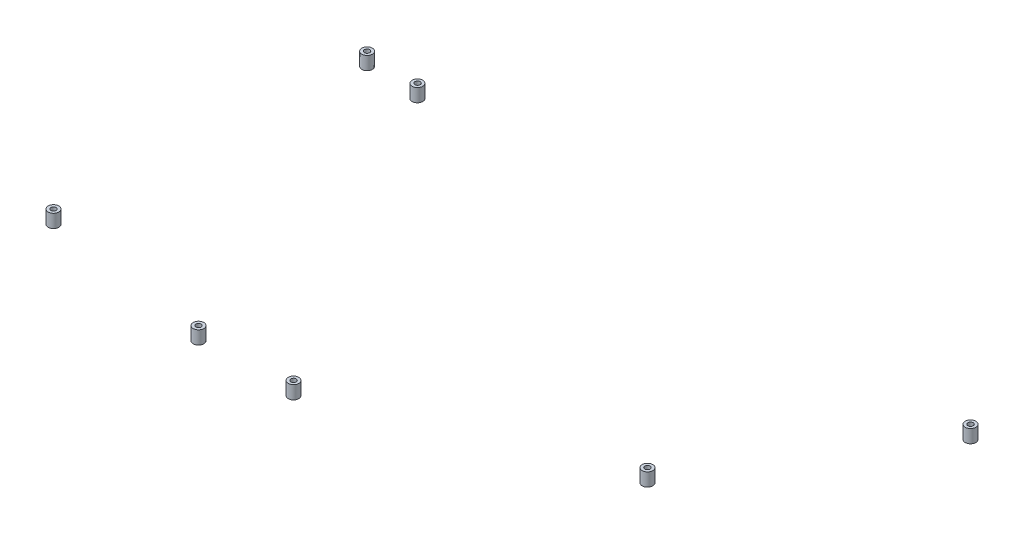
ISO-10303-21;
HEADER;
FILE_DESCRIPTION(('STEP AP214'),'2;1');
FILE_NAME('part.step','',(''),(''),'','','');
FILE_SCHEMA(('AUTOMOTIVE_DESIGN { 1 0 10303 214 1 1 1 1 }'));
ENDSEC;
DATA;
#1=APPLICATION_CONTEXT('core data for automotive mechanical design processes');
#2=APPLICATION_PROTOCOL_DEFINITION('international standard','automotive_design',2000,#1);
#3=PRODUCT_CONTEXT('',#1,'mechanical');
#4=PRODUCT('Part','Part','',(#3));
#5=PRODUCT_RELATED_PRODUCT_CATEGORY('part','',(#4));
#6=PRODUCT_DEFINITION_FORMATION('','',#4);
#7=PRODUCT_DEFINITION_CONTEXT('part definition',#1,'design');
#8=PRODUCT_DEFINITION('design','',#6,#7);
#9=PRODUCT_DEFINITION_SHAPE('','',#8);
#10=(LENGTH_UNIT() NAMED_UNIT(*) SI_UNIT(.MILLI.,.METRE.));
#11=(NAMED_UNIT(*) PLANE_ANGLE_UNIT() SI_UNIT($,.RADIAN.));
#12=(NAMED_UNIT(*) SI_UNIT($,.STERADIAN.) SOLID_ANGLE_UNIT());
#13=UNCERTAINTY_MEASURE_WITH_UNIT(LENGTH_MEASURE(1.E-05),#10,'distance_accuracy_value','');
#14=(GEOMETRIC_REPRESENTATION_CONTEXT(3) GLOBAL_UNCERTAINTY_ASSIGNED_CONTEXT((#13)) GLOBAL_UNIT_ASSIGNED_CONTEXT((#10,
#11,#12)) REPRESENTATION_CONTEXT('',''));
#15=CARTESIAN_POINT('',(0.,0.,0.));
#16=DIRECTION('',(0.,0.,1.));
#17=DIRECTION('',(1.,0.,0.));
#18=AXIS2_PLACEMENT_3D('',#15,#16,#17);
#19=CARTESIAN_POINT('',(-572.687982615384,445.3,-206.365683114483));
#20=DIRECTION('',(0.,1.,0.));
#21=DIRECTION('',(0.,0.,-1.));
#22=AXIS2_PLACEMENT_3D('',#19,#20,#21);
#23=CYLINDRICAL_SURFACE('',#22,3.99999999999989);
#24=CARTESIAN_POINT('',(-572.687982615384,445.3,-206.365683114483));
#25=DIRECTION('',(0.,-1.,0.));
#26=DIRECTION('',(0.,0.,-1.));
#27=AXIS2_PLACEMENT_3D('',#24,#25,#26);
#28=CIRCLE('',#27,3.99999999999989);
#29=CARTESIAN_POINT('',(-572.687982615384,445.3,-210.365683114483));
#30=VERTEX_POINT('',#29);
#31=EDGE_CURVE('E11',#30,#30,#28,.T.);
#32=ORIENTED_EDGE('',*,*,#31,.F.);
#33=EDGE_LOOP('',(#32));
#34=FACE_BOUND('',#33,.T.);
#35=CARTESIAN_POINT('',(-572.687982615384,455.3,-206.365683114483));
#36=DIRECTION('',(0.,-1.,0.));
#37=DIRECTION('',(0.,0.,-1.));
#38=AXIS2_PLACEMENT_3D('',#35,#36,#37);
#39=CIRCLE('',#38,3.99999999999989);
#40=CARTESIAN_POINT('',(-572.687982615384,455.3,-210.365683114483));
#41=VERTEX_POINT('',#40);
#42=EDGE_CURVE('E47',#41,#41,#39,.T.);
#43=ORIENTED_EDGE('',*,*,#42,.T.);
#44=EDGE_LOOP('',(#43));
#45=FACE_BOUND('',#44,.T.);
#46=ADVANCED_FACE('F44',(#34,#45),#23,.T.);
#47=CARTESIAN_POINT('',(-572.687982615384,445.3,-206.365683114483));
#48=DIRECTION('',(0.,1.,0.));
#49=DIRECTION('',(0.,0.,-1.));
#50=AXIS2_PLACEMENT_3D('',#47,#48,#49);
#51=PLANE('',#50);
#52=CARTESIAN_POINT('',(-572.687982615384,445.3,-206.365683114483));
#53=DIRECTION('',(0.,-1.,0.));
#54=DIRECTION('',(0.,0.,-1.));
#55=AXIS2_PLACEMENT_3D('',#52,#53,#54);
#56=CIRCLE('',#55,1.99999999999989);
#57=CARTESIAN_POINT('',(-572.687982615384,445.3,-208.365683114483));
#58=VERTEX_POINT('',#57);
#59=EDGE_CURVE('E54',#58,#58,#56,.T.);
#60=ORIENTED_EDGE('',*,*,#59,.F.);
#61=EDGE_LOOP('',(#60));
#62=FACE_BOUND('',#61,.T.);
#63=ORIENTED_EDGE('',*,*,#31,.T.);
#64=EDGE_LOOP('',(#63));
#65=FACE_BOUND('',#64,.T.);
#66=ADVANCED_FACE('F65',(#62,#65),#51,.F.);
#67=CARTESIAN_POINT('',(-572.687982615384,455.3,-206.365683114483));
#68=DIRECTION('',(0.,1.,0.));
#69=DIRECTION('',(0.,0.,-1.));
#70=AXIS2_PLACEMENT_3D('',#67,#68,#69);
#71=PLANE('',#70);
#72=CARTESIAN_POINT('',(-572.687982615384,455.3,-206.365683114483));
#73=DIRECTION('',(0.,-1.,0.));
#74=DIRECTION('',(0.,0.,-1.));
#75=AXIS2_PLACEMENT_3D('',#72,#73,#74);
#76=CIRCLE('',#75,1.99999999999989);
#77=CARTESIAN_POINT('',(-572.687982615384,455.3,-208.365683114483));
#78=VERTEX_POINT('',#77);
#79=EDGE_CURVE('E56',#78,#78,#76,.T.);
#80=ORIENTED_EDGE('',*,*,#79,.T.);
#81=EDGE_LOOP('',(#80));
#82=FACE_BOUND('',#81,.T.);
#83=ORIENTED_EDGE('',*,*,#42,.F.);
#84=EDGE_LOOP('',(#83));
#85=FACE_BOUND('',#84,.T.);
#86=ADVANCED_FACE('F67',(#82,#85),#71,.T.);
#87=CARTESIAN_POINT('',(-572.687982615384,445.3,-206.365683114483));
#88=DIRECTION('',(0.,1.,0.));
#89=DIRECTION('',(0.,0.,-1.));
#90=AXIS2_PLACEMENT_3D('',#87,#88,#89);
#91=CYLINDRICAL_SURFACE('',#90,1.99999999999989);
#92=ORIENTED_EDGE('',*,*,#59,.T.);
#93=EDGE_LOOP('',(#92));
#94=FACE_BOUND('',#93,.T.);
#95=ORIENTED_EDGE('',*,*,#79,.F.);
#96=EDGE_LOOP('',(#95));
#97=FACE_BOUND('',#96,.T.);
#98=ADVANCED_FACE('F62',(#94,#97),#91,.F.);
#99=CLOSED_SHELL('',(#46,#66,#86,#98));
#100=MANIFOLD_SOLID_BREP('B2',#99);
#101=CARTESIAN_POINT('',(-441.66371710956,445.3,-184.906368668602));
#102=DIRECTION('',(0.,1.,0.));
#103=DIRECTION('',(0.,0.,-1.));
#104=AXIS2_PLACEMENT_3D('',#101,#102,#103);
#105=CYLINDRICAL_SURFACE('',#104,3.99999999999999);
#106=CARTESIAN_POINT('',(-441.66371710956,445.3,-184.906368668602));
#107=DIRECTION('',(0.,-1.,0.));
#108=DIRECTION('',(0.,0.,-1.));
#109=AXIS2_PLACEMENT_3D('',#106,#107,#108);
#110=CIRCLE('',#109,3.99999999999999);
#111=CARTESIAN_POINT('',(-441.66371710956,445.3,-188.906368668602));
#112=VERTEX_POINT('',#111);
#113=EDGE_CURVE('E43',#112,#112,#110,.T.);
#114=ORIENTED_EDGE('',*,*,#113,.F.);
#115=EDGE_LOOP('',(#114));
#116=FACE_BOUND('',#115,.T.);
#117=CARTESIAN_POINT('',(-441.66371710956,455.3,-184.906368668602));
#118=DIRECTION('',(0.,-1.,0.));
#119=DIRECTION('',(0.,0.,-1.));
#120=AXIS2_PLACEMENT_3D('',#117,#118,#119);
#121=CIRCLE('',#120,3.99999999999999);
#122=CARTESIAN_POINT('',(-441.66371710956,455.3,-188.906368668602));
#123=VERTEX_POINT('',#122);
#124=EDGE_CURVE('E117',#123,#123,#121,.T.);
#125=ORIENTED_EDGE('',*,*,#124,.T.);
#126=EDGE_LOOP('',(#125));
#127=FACE_BOUND('',#126,.T.);
#128=ADVANCED_FACE('F114',(#116,#127),#105,.T.);
#129=CARTESIAN_POINT('',(-441.66371710956,445.3,-184.906368668602));
#130=DIRECTION('',(0.,1.,0.));
#131=DIRECTION('',(0.,0.,-1.));
#132=AXIS2_PLACEMENT_3D('',#129,#130,#131);
#133=PLANE('',#132);
#134=CARTESIAN_POINT('',(-441.66371710956,445.3,-184.906368668602));
#135=DIRECTION('',(0.,-1.,0.));
#136=DIRECTION('',(0.,0.,-1.));
#137=AXIS2_PLACEMENT_3D('',#134,#135,#136);
#138=CIRCLE('',#137,2.);
#139=CARTESIAN_POINT('',(-441.66371710956,445.3,-186.906368668602));
#140=VERTEX_POINT('',#139);
#141=EDGE_CURVE('E124',#140,#140,#138,.T.);
#142=ORIENTED_EDGE('',*,*,#141,.F.);
#143=EDGE_LOOP('',(#142));
#144=FACE_BOUND('',#143,.T.);
#145=ORIENTED_EDGE('',*,*,#113,.T.);
#146=EDGE_LOOP('',(#145));
#147=FACE_BOUND('',#146,.T.);
#148=ADVANCED_FACE('F135',(#144,#147),#133,.F.);
#149=CARTESIAN_POINT('',(-441.66371710956,455.3,-184.906368668602));
#150=DIRECTION('',(0.,1.,0.));
#151=DIRECTION('',(0.,0.,-1.));
#152=AXIS2_PLACEMENT_3D('',#149,#150,#151);
#153=PLANE('',#152);
#154=CARTESIAN_POINT('',(-441.66371710956,455.3,-184.906368668602));
#155=DIRECTION('',(0.,-1.,0.));
#156=DIRECTION('',(0.,0.,-1.));
#157=AXIS2_PLACEMENT_3D('',#154,#155,#156);
#158=CIRCLE('',#157,2.);
#159=CARTESIAN_POINT('',(-441.66371710956,455.3,-186.906368668602));
#160=VERTEX_POINT('',#159);
#161=EDGE_CURVE('E126',#160,#160,#158,.T.);
#162=ORIENTED_EDGE('',*,*,#161,.T.);
#163=EDGE_LOOP('',(#162));
#164=FACE_BOUND('',#163,.T.);
#165=ORIENTED_EDGE('',*,*,#124,.F.);
#166=EDGE_LOOP('',(#165));
#167=FACE_BOUND('',#166,.T.);
#168=ADVANCED_FACE('F137',(#164,#167),#153,.T.);
#169=CARTESIAN_POINT('',(-441.66371710956,445.3,-184.906368668602));
#170=DIRECTION('',(0.,1.,0.));
#171=DIRECTION('',(0.,0.,-1.));
#172=AXIS2_PLACEMENT_3D('',#169,#170,#171);
#173=CYLINDRICAL_SURFACE('',#172,2.);
#174=ORIENTED_EDGE('',*,*,#141,.T.);
#175=EDGE_LOOP('',(#174));
#176=FACE_BOUND('',#175,.T.);
#177=ORIENTED_EDGE('',*,*,#161,.F.);
#178=EDGE_LOOP('',(#177));
#179=FACE_BOUND('',#178,.T.);
#180=ADVANCED_FACE('F132',(#176,#179),#173,.F.);
#181=CLOSED_SHELL('',(#128,#148,#168,#180));
#182=MANIFOLD_SOLID_BREP('B6',#181);
#183=CARTESIAN_POINT('',(-369.907883248264,445.3,-184.906368668627));
#184=DIRECTION('',(0.,1.,0.));
#185=DIRECTION('',(0.,0.,-1.));
#186=AXIS2_PLACEMENT_3D('',#183,#184,#185);
#187=CYLINDRICAL_SURFACE('',#186,3.99999999999999);
#188=CARTESIAN_POINT('',(-369.907883248264,445.3,-184.906368668627));
#189=DIRECTION('',(0.,-1.,0.));
#190=DIRECTION('',(0.,0.,-1.));
#191=AXIS2_PLACEMENT_3D('',#188,#189,#190);
#192=CIRCLE('',#191,3.99999999999999);
#193=CARTESIAN_POINT('',(-369.907883248264,445.3,-188.906368668627));
#194=VERTEX_POINT('',#193);
#195=EDGE_CURVE('E113',#194,#194,#192,.T.);
#196=ORIENTED_EDGE('',*,*,#195,.F.);
#197=EDGE_LOOP('',(#196));
#198=FACE_BOUND('',#197,.T.);
#199=CARTESIAN_POINT('',(-369.907883248264,455.3,-184.906368668627));
#200=DIRECTION('',(0.,-1.,0.));
#201=DIRECTION('',(0.,0.,-1.));
#202=AXIS2_PLACEMENT_3D('',#199,#200,#201);
#203=CIRCLE('',#202,3.99999999999999);
#204=CARTESIAN_POINT('',(-369.907883248264,455.3,-188.906368668627));
#205=VERTEX_POINT('',#204);
#206=EDGE_CURVE('E187',#205,#205,#203,.T.);
#207=ORIENTED_EDGE('',*,*,#206,.T.);
#208=EDGE_LOOP('',(#207));
#209=FACE_BOUND('',#208,.T.);
#210=ADVANCED_FACE('F184',(#198,#209),#187,.T.);
#211=CARTESIAN_POINT('',(-369.907883248264,445.3,-184.906368668627));
#212=DIRECTION('',(0.,1.,0.));
#213=DIRECTION('',(0.,0.,-1.));
#214=AXIS2_PLACEMENT_3D('',#211,#212,#213);
#215=PLANE('',#214);
#216=CARTESIAN_POINT('',(-369.907883248264,445.3,-184.906368668627));
#217=DIRECTION('',(0.,-1.,0.));
#218=DIRECTION('',(0.,0.,-1.));
#219=AXIS2_PLACEMENT_3D('',#216,#217,#218);
#220=CIRCLE('',#219,2.);
#221=CARTESIAN_POINT('',(-369.907883248264,445.3,-186.906368668627));
#222=VERTEX_POINT('',#221);
#223=EDGE_CURVE('E194',#222,#222,#220,.T.);
#224=ORIENTED_EDGE('',*,*,#223,.F.);
#225=EDGE_LOOP('',(#224));
#226=FACE_BOUND('',#225,.T.);
#227=ORIENTED_EDGE('',*,*,#195,.T.);
#228=EDGE_LOOP('',(#227));
#229=FACE_BOUND('',#228,.T.);
#230=ADVANCED_FACE('F205',(#226,#229),#215,.F.);
#231=CARTESIAN_POINT('',(-369.907883248264,455.3,-184.906368668627));
#232=DIRECTION('',(0.,1.,0.));
#233=DIRECTION('',(0.,0.,-1.));
#234=AXIS2_PLACEMENT_3D('',#231,#232,#233);
#235=PLANE('',#234);
#236=CARTESIAN_POINT('',(-369.907883248264,455.3,-184.906368668627));
#237=DIRECTION('',(0.,-1.,0.));
#238=DIRECTION('',(0.,0.,-1.));
#239=AXIS2_PLACEMENT_3D('',#236,#237,#238);
#240=CIRCLE('',#239,2.);
#241=CARTESIAN_POINT('',(-369.907883248264,455.3,-186.906368668627));
#242=VERTEX_POINT('',#241);
#243=EDGE_CURVE('E196',#242,#242,#240,.T.);
#244=ORIENTED_EDGE('',*,*,#243,.T.);
#245=EDGE_LOOP('',(#244));
#246=FACE_BOUND('',#245,.T.);
#247=ORIENTED_EDGE('',*,*,#206,.F.);
#248=EDGE_LOOP('',(#247));
#249=FACE_BOUND('',#248,.T.);
#250=ADVANCED_FACE('F207',(#246,#249),#235,.T.);
#251=CARTESIAN_POINT('',(-369.907883248264,445.3,-184.906368668627));
#252=DIRECTION('',(0.,1.,0.));
#253=DIRECTION('',(0.,0.,-1.));
#254=AXIS2_PLACEMENT_3D('',#251,#252,#253);
#255=CYLINDRICAL_SURFACE('',#254,2.);
#256=ORIENTED_EDGE('',*,*,#223,.T.);
#257=EDGE_LOOP('',(#256));
#258=FACE_BOUND('',#257,.T.);
#259=ORIENTED_EDGE('',*,*,#243,.F.);
#260=EDGE_LOOP('',(#259));
#261=FACE_BOUND('',#260,.T.);
#262=ADVANCED_FACE('F202',(#258,#261),#255,.F.);
#263=CLOSED_SHELL('',(#210,#230,#250,#262));
#264=MANIFOLD_SOLID_BREP('B38',#263);
#265=CARTESIAN_POINT('',(-179.166238959035,445.3,-261.544556892205));
#266=DIRECTION('',(0.,1.,0.));
#267=DIRECTION('',(0.,0.,-1.));
#268=AXIS2_PLACEMENT_3D('',#265,#266,#267);
#269=CYLINDRICAL_SURFACE('',#268,3.99999999925614);
#270=CARTESIAN_POINT('',(-179.166238959035,445.3,-261.544556892205));
#271=DIRECTION('',(0.,-1.,0.));
#272=DIRECTION('',(0.,0.,-1.));
#273=AXIS2_PLACEMENT_3D('',#270,#271,#272);
#274=CIRCLE('',#273,3.99999999925614);
#275=CARTESIAN_POINT('',(-179.166238959035,445.3,-265.544556891461));
#276=VERTEX_POINT('',#275);
#277=EDGE_CURVE('E183',#276,#276,#274,.T.);
#278=ORIENTED_EDGE('',*,*,#277,.F.);
#279=EDGE_LOOP('',(#278));
#280=FACE_BOUND('',#279,.T.);
#281=CARTESIAN_POINT('',(-179.166238959035,455.3,-261.544556892205));
#282=DIRECTION('',(0.,-1.,0.));
#283=DIRECTION('',(0.,0.,-1.));
#284=AXIS2_PLACEMENT_3D('',#281,#282,#283);
#285=CIRCLE('',#284,3.99999999925614);
#286=CARTESIAN_POINT('',(-179.166238959035,455.3,-265.544556891461));
#287=VERTEX_POINT('',#286);
#288=EDGE_CURVE('E257',#287,#287,#285,.T.);
#289=ORIENTED_EDGE('',*,*,#288,.T.);
#290=EDGE_LOOP('',(#289));
#291=FACE_BOUND('',#290,.T.);
#292=ADVANCED_FACE('F254',(#280,#291),#269,.T.);
#293=CARTESIAN_POINT('',(-179.166238959035,445.3,-261.544556892205));
#294=DIRECTION('',(0.,1.,0.));
#295=DIRECTION('',(0.,0.,-1.));
#296=AXIS2_PLACEMENT_3D('',#293,#294,#295);
#297=PLANE('',#296);
#298=CARTESIAN_POINT('',(-179.166238959035,445.3,-261.544556892205));
#299=DIRECTION('',(0.,-1.,0.));
#300=DIRECTION('',(0.,0.,-1.));
#301=AXIS2_PLACEMENT_3D('',#298,#299,#300);
#302=CIRCLE('',#301,2.);
#303=CARTESIAN_POINT('',(-179.166238959035,445.3,-263.544556892205));
#304=VERTEX_POINT('',#303);
#305=EDGE_CURVE('E264',#304,#304,#302,.T.);
#306=ORIENTED_EDGE('',*,*,#305,.F.);
#307=EDGE_LOOP('',(#306));
#308=FACE_BOUND('',#307,.T.);
#309=ORIENTED_EDGE('',*,*,#277,.T.);
#310=EDGE_LOOP('',(#309));
#311=FACE_BOUND('',#310,.T.);
#312=ADVANCED_FACE('F275',(#308,#311),#297,.F.);
#313=CARTESIAN_POINT('',(-179.166238959035,455.3,-261.544556892205));
#314=DIRECTION('',(0.,1.,0.));
#315=DIRECTION('',(0.,0.,-1.));
#316=AXIS2_PLACEMENT_3D('',#313,#314,#315);
#317=PLANE('',#316);
#318=CARTESIAN_POINT('',(-179.166238959035,455.3,-261.544556892205));
#319=DIRECTION('',(0.,-1.,0.));
#320=DIRECTION('',(0.,0.,-1.));
#321=AXIS2_PLACEMENT_3D('',#318,#319,#320);
#322=CIRCLE('',#321,2.);
#323=CARTESIAN_POINT('',(-179.166238959035,455.3,-263.544556892205));
#324=VERTEX_POINT('',#323);
#325=EDGE_CURVE('E266',#324,#324,#322,.T.);
#326=ORIENTED_EDGE('',*,*,#325,.T.);
#327=EDGE_LOOP('',(#326));
#328=FACE_BOUND('',#327,.T.);
#329=ORIENTED_EDGE('',*,*,#288,.F.);
#330=EDGE_LOOP('',(#329));
#331=FACE_BOUND('',#330,.T.);
#332=ADVANCED_FACE('F277',(#328,#331),#317,.T.);
#333=CARTESIAN_POINT('',(-179.166238959035,445.3,-261.544556892205));
#334=DIRECTION('',(0.,1.,0.));
#335=DIRECTION('',(0.,0.,-1.));
#336=AXIS2_PLACEMENT_3D('',#333,#334,#335);
#337=CYLINDRICAL_SURFACE('',#336,2.);
#338=ORIENTED_EDGE('',*,*,#305,.T.);
#339=EDGE_LOOP('',(#338));
#340=FACE_BOUND('',#339,.T.);
#341=ORIENTED_EDGE('',*,*,#325,.F.);
#342=EDGE_LOOP('',(#341));
#343=FACE_BOUND('',#342,.T.);
#344=ADVANCED_FACE('F272',(#340,#343),#337,.F.);
#345=CLOSED_SHELL('',(#292,#312,#332,#344));
#346=MANIFOLD_SOLID_BREP('B108',#345);
#347=CARTESIAN_POINT('',(-85.5135337309273,445.3,-411.920534849114));
#348=DIRECTION('',(0.,1.,0.));
#349=DIRECTION('',(0.,0.,-1.));
#350=AXIS2_PLACEMENT_3D('',#347,#348,#349);
#351=CYLINDRICAL_SURFACE('',#350,3.99999999992161);
#352=CARTESIAN_POINT('',(-85.5135337309273,445.3,-411.920534849114));
#353=DIRECTION('',(0.,-1.,0.));
#354=DIRECTION('',(0.,0.,-1.));
#355=AXIS2_PLACEMENT_3D('',#352,#353,#354);
#356=CIRCLE('',#355,3.99999999992161);
#357=CARTESIAN_POINT('',(-85.5135337309273,445.3,-415.920534849036));
#358=VERTEX_POINT('',#357);
#359=EDGE_CURVE('E253',#358,#358,#356,.T.);
#360=ORIENTED_EDGE('',*,*,#359,.F.);
#361=EDGE_LOOP('',(#360));
#362=FACE_BOUND('',#361,.T.);
#363=CARTESIAN_POINT('',(-85.5135337309273,455.3,-411.920534849114));
#364=DIRECTION('',(0.,-1.,0.));
#365=DIRECTION('',(0.,0.,-1.));
#366=AXIS2_PLACEMENT_3D('',#363,#364,#365);
#367=CIRCLE('',#366,3.99999999992161);
#368=CARTESIAN_POINT('',(-85.5135337309273,455.3,-415.920534849036));
#369=VERTEX_POINT('',#368);
#370=EDGE_CURVE('E327',#369,#369,#367,.T.);
#371=ORIENTED_EDGE('',*,*,#370,.T.);
#372=EDGE_LOOP('',(#371));
#373=FACE_BOUND('',#372,.T.);
#374=ADVANCED_FACE('F324',(#362,#373),#351,.T.);
#375=CARTESIAN_POINT('',(-85.5135337309273,445.3,-411.920534849114));
#376=DIRECTION('',(0.,1.,0.));
#377=DIRECTION('',(0.,0.,-1.));
#378=AXIS2_PLACEMENT_3D('',#375,#376,#377);
#379=PLANE('',#378);
#380=CARTESIAN_POINT('',(-85.5135337309273,445.3,-411.920534849114));
#381=DIRECTION('',(0.,-1.,0.));
#382=DIRECTION('',(0.,0.,-1.));
#383=AXIS2_PLACEMENT_3D('',#380,#381,#382);
#384=CIRCLE('',#383,2.);
#385=CARTESIAN_POINT('',(-85.5135337309273,445.3,-413.920534849114));
#386=VERTEX_POINT('',#385);
#387=EDGE_CURVE('E334',#386,#386,#384,.T.);
#388=ORIENTED_EDGE('',*,*,#387,.F.);
#389=EDGE_LOOP('',(#388));
#390=FACE_BOUND('',#389,.T.);
#391=ORIENTED_EDGE('',*,*,#359,.T.);
#392=EDGE_LOOP('',(#391));
#393=FACE_BOUND('',#392,.T.);
#394=ADVANCED_FACE('F345',(#390,#393),#379,.F.);
#395=CARTESIAN_POINT('',(-85.5135337309273,455.3,-411.920534849114));
#396=DIRECTION('',(0.,1.,0.));
#397=DIRECTION('',(0.,0.,-1.));
#398=AXIS2_PLACEMENT_3D('',#395,#396,#397);
#399=PLANE('',#398);
#400=CARTESIAN_POINT('',(-85.5135337309273,455.3,-411.920534849114));
#401=DIRECTION('',(0.,-1.,0.));
#402=DIRECTION('',(0.,0.,-1.));
#403=AXIS2_PLACEMENT_3D('',#400,#401,#402);
#404=CIRCLE('',#403,2.);
#405=CARTESIAN_POINT('',(-85.5135337309273,455.3,-413.920534849114));
#406=VERTEX_POINT('',#405);
#407=EDGE_CURVE('E336',#406,#406,#404,.T.);
#408=ORIENTED_EDGE('',*,*,#407,.T.);
#409=EDGE_LOOP('',(#408));
#410=FACE_BOUND('',#409,.T.);
#411=ORIENTED_EDGE('',*,*,#370,.F.);
#412=EDGE_LOOP('',(#411));
#413=FACE_BOUND('',#412,.T.);
#414=ADVANCED_FACE('F347',(#410,#413),#399,.T.);
#415=CARTESIAN_POINT('',(-85.5135337309273,445.3,-411.920534849114));
#416=DIRECTION('',(0.,1.,0.));
#417=DIRECTION('',(0.,0.,-1.));
#418=AXIS2_PLACEMENT_3D('',#415,#416,#417);
#419=CYLINDRICAL_SURFACE('',#418,2.);
#420=ORIENTED_EDGE('',*,*,#387,.T.);
#421=EDGE_LOOP('',(#420));
#422=FACE_BOUND('',#421,.T.);
#423=ORIENTED_EDGE('',*,*,#407,.F.);
#424=EDGE_LOOP('',(#423));
#425=FACE_BOUND('',#424,.T.);
#426=ADVANCED_FACE('F342',(#422,#425),#419,.F.);
#427=CLOSED_SHELL('',(#374,#394,#414,#426));
#428=MANIFOLD_SOLID_BREP('B178',#427);
#429=CARTESIAN_POINT('',(-517.500474948423,445.3,-426.079389265339));
#430=DIRECTION('',(0.,1.,0.));
#431=DIRECTION('',(0.,0.,-1.));
#432=AXIS2_PLACEMENT_3D('',#429,#430,#431);
#433=CYLINDRICAL_SURFACE('',#432,3.99999999980982);
#434=CARTESIAN_POINT('',(-517.500474948423,445.3,-426.079389265339));
#435=DIRECTION('',(0.,-1.,0.));
#436=DIRECTION('',(0.,0.,-1.));
#437=AXIS2_PLACEMENT_3D('',#434,#435,#436);
#438=CIRCLE('',#437,3.99999999980982);
#439=CARTESIAN_POINT('',(-517.500474948423,445.3,-430.079389265148));
#440=VERTEX_POINT('',#439);
#441=EDGE_CURVE('E323',#440,#440,#438,.T.);
#442=ORIENTED_EDGE('',*,*,#441,.F.);
#443=EDGE_LOOP('',(#442));
#444=FACE_BOUND('',#443,.T.);
#445=CARTESIAN_POINT('',(-517.500474948423,455.3,-426.079389265339));
#446=DIRECTION('',(0.,-1.,0.));
#447=DIRECTION('',(0.,0.,-1.));
#448=AXIS2_PLACEMENT_3D('',#445,#446,#447);
#449=CIRCLE('',#448,3.99999999980982);
#450=CARTESIAN_POINT('',(-517.500474948423,455.3,-430.079389265148));
#451=VERTEX_POINT('',#450);
#452=EDGE_CURVE('E396',#451,#451,#449,.T.);
#453=ORIENTED_EDGE('',*,*,#452,.T.);
#454=EDGE_LOOP('',(#453));
#455=FACE_BOUND('',#454,.T.);
#456=ADVANCED_FACE('F393',(#444,#455),#433,.T.);
#457=CARTESIAN_POINT('',(-517.500474948423,445.3,-426.079389265339));
#458=DIRECTION('',(0.,1.,0.));
#459=DIRECTION('',(0.,0.,-1.));
#460=AXIS2_PLACEMENT_3D('',#457,#458,#459);
#461=PLANE('',#460);
#462=CARTESIAN_POINT('',(-517.500474948349,445.3,-426.174740181972));
#463=DIRECTION('',(0.,-1.,0.));
#464=DIRECTION('',(0.,0.,-1.));
#465=AXIS2_PLACEMENT_3D('',#462,#463,#464);
#466=CIRCLE('',#465,2.);
#467=CARTESIAN_POINT('',(-517.500474948349,445.3,-428.174740181972));
#468=VERTEX_POINT('',#467);
#469=EDGE_CURVE('E403',#468,#468,#466,.T.);
#470=ORIENTED_EDGE('',*,*,#469,.F.);
#471=EDGE_LOOP('',(#470));
#472=FACE_BOUND('',#471,.T.);
#473=ORIENTED_EDGE('',*,*,#441,.T.);
#474=EDGE_LOOP('',(#473));
#475=FACE_BOUND('',#474,.T.);
#476=ADVANCED_FACE('F414',(#472,#475),#461,.F.);
#477=CARTESIAN_POINT('',(-517.500474948423,455.3,-426.079389265339));
#478=DIRECTION('',(0.,1.,0.));
#479=DIRECTION('',(0.,0.,-1.));
#480=AXIS2_PLACEMENT_3D('',#477,#478,#479);
#481=PLANE('',#480);
#482=CARTESIAN_POINT('',(-517.500474948349,455.3,-426.174740181972));
#483=DIRECTION('',(0.,-1.,0.));
#484=DIRECTION('',(0.,0.,-1.));
#485=AXIS2_PLACEMENT_3D('',#482,#483,#484);
#486=CIRCLE('',#485,2.);
#487=CARTESIAN_POINT('',(-517.500474948349,455.3,-428.174740181972));
#488=VERTEX_POINT('',#487);
#489=EDGE_CURVE('E405',#488,#488,#486,.T.);
#490=ORIENTED_EDGE('',*,*,#489,.T.);
#491=EDGE_LOOP('',(#490));
#492=FACE_BOUND('',#491,.T.);
#493=ORIENTED_EDGE('',*,*,#452,.F.);
#494=EDGE_LOOP('',(#493));
#495=FACE_BOUND('',#494,.T.);
#496=ADVANCED_FACE('F416',(#492,#495),#481,.T.);
#497=CARTESIAN_POINT('',(-517.500474948349,445.3,-426.174740181972));
#498=DIRECTION('',(0.,1.,0.));
#499=DIRECTION('',(0.,0.,-1.));
#500=AXIS2_PLACEMENT_3D('',#497,#498,#499);
#501=CYLINDRICAL_SURFACE('',#500,2.);
#502=ORIENTED_EDGE('',*,*,#469,.T.);
#503=EDGE_LOOP('',(#502));
#504=FACE_BOUND('',#503,.T.);
#505=ORIENTED_EDGE('',*,*,#489,.F.);
#506=EDGE_LOOP('',(#505));
#507=FACE_BOUND('',#506,.T.);
#508=ADVANCED_FACE('F411',(#504,#507),#501,.F.);
#509=CLOSED_SHELL('',(#456,#476,#496,#508));
#510=MANIFOLD_SOLID_BREP('B248',#509);
#511=CARTESIAN_POINT('',(-557.500474948423,445.3,-428.07638853208));
#512=DIRECTION('',(0.,1.,0.));
#513=DIRECTION('',(0.,0.,-1.));
#514=AXIS2_PLACEMENT_3D('',#511,#512,#513);
#515=CYLINDRICAL_SURFACE('',#514,3.99999999980982);
#516=CARTESIAN_POINT('',(-557.500474948423,445.3,-428.07638853208));
#517=DIRECTION('',(0.,-1.,0.));
#518=DIRECTION('',(0.,0.,-1.));
#519=AXIS2_PLACEMENT_3D('',#516,#517,#518);
#520=CIRCLE('',#519,3.99999999980982);
#521=CARTESIAN_POINT('',(-557.500474948423,445.3,-432.07638853189));
#522=VERTEX_POINT('',#521);
#523=EDGE_CURVE('E392',#522,#522,#520,.T.);
#524=ORIENTED_EDGE('',*,*,#523,.F.);
#525=EDGE_LOOP('',(#524));
#526=FACE_BOUND('',#525,.T.);
#527=CARTESIAN_POINT('',(-557.500474948423,455.3,-428.07638853208));
#528=DIRECTION('',(0.,-1.,0.));
#529=DIRECTION('',(0.,0.,-1.));
#530=AXIS2_PLACEMENT_3D('',#527,#528,#529);
#531=CIRCLE('',#530,3.99999999980982);
#532=CARTESIAN_POINT('',(-557.500474948423,455.3,-432.07638853189));
#533=VERTEX_POINT('',#532);
#534=EDGE_CURVE('E458',#533,#533,#531,.T.);
#535=ORIENTED_EDGE('',*,*,#534,.T.);
#536=EDGE_LOOP('',(#535));
#537=FACE_BOUND('',#536,.T.);
#538=ADVANCED_FACE('F455',(#526,#537),#515,.T.);
#539=CARTESIAN_POINT('',(-557.500474948423,445.3,-428.07638853208));
#540=DIRECTION('',(0.,1.,0.));
#541=DIRECTION('',(0.,0.,-1.));
#542=AXIS2_PLACEMENT_3D('',#539,#540,#541);
#543=PLANE('',#542);
#544=CARTESIAN_POINT('',(-557.500474948349,445.3,-428.0451748271));
#545=DIRECTION('',(0.,-1.,0.));
#546=DIRECTION('',(0.,0.,-1.));
#547=AXIS2_PLACEMENT_3D('',#544,#545,#546);
#548=CIRCLE('',#547,2.);
#549=CARTESIAN_POINT('',(-557.500474948349,445.3,-430.0451748271));
#550=VERTEX_POINT('',#549);
#551=EDGE_CURVE('E465',#550,#550,#548,.T.);
#552=ORIENTED_EDGE('',*,*,#551,.F.);
#553=EDGE_LOOP('',(#552));
#554=FACE_BOUND('',#553,.T.);
#555=ORIENTED_EDGE('',*,*,#523,.T.);
#556=EDGE_LOOP('',(#555));
#557=FACE_BOUND('',#556,.T.);
#558=ADVANCED_FACE('F476',(#554,#557),#543,.F.);
#559=CARTESIAN_POINT('',(-557.500474948423,455.3,-428.07638853208));
#560=DIRECTION('',(0.,1.,0.));
#561=DIRECTION('',(0.,0.,-1.));
#562=AXIS2_PLACEMENT_3D('',#559,#560,#561);
#563=PLANE('',#562);
#564=CARTESIAN_POINT('',(-557.500474948349,455.3,-428.0451748271));
#565=DIRECTION('',(0.,-1.,0.));
#566=DIRECTION('',(0.,0.,-1.));
#567=AXIS2_PLACEMENT_3D('',#564,#565,#566);
#568=CIRCLE('',#567,2.);
#569=CARTESIAN_POINT('',(-557.500474948349,455.3,-430.0451748271));
#570=VERTEX_POINT('',#569);
#571=EDGE_CURVE('E467',#570,#570,#568,.T.);
#572=ORIENTED_EDGE('',*,*,#571,.T.);
#573=EDGE_LOOP('',(#572));
#574=FACE_BOUND('',#573,.T.);
#575=ORIENTED_EDGE('',*,*,#534,.F.);
#576=EDGE_LOOP('',(#575));
#577=FACE_BOUND('',#576,.T.);
#578=ADVANCED_FACE('F478',(#574,#577),#563,.T.);
#579=CARTESIAN_POINT('',(-557.500474948349,445.3,-428.0451748271));
#580=DIRECTION('',(0.,1.,0.));
#581=DIRECTION('',(0.,0.,-1.));
#582=AXIS2_PLACEMENT_3D('',#579,#580,#581);
#583=CYLINDRICAL_SURFACE('',#582,2.);
#584=ORIENTED_EDGE('',*,*,#551,.T.);
#585=EDGE_LOOP('',(#584));
#586=FACE_BOUND('',#585,.T.);
#587=ORIENTED_EDGE('',*,*,#571,.F.);
#588=EDGE_LOOP('',(#587));
#589=FACE_BOUND('',#588,.T.);
#590=ADVANCED_FACE('F473',(#586,#589),#583,.F.);
#591=CLOSED_SHELL('',(#538,#558,#578,#590));
#592=MANIFOLD_SOLID_BREP('B318',#591);
#593=ADVANCED_BREP_SHAPE_REPRESENTATION('',(#18,#100,#182,#264,#346,#428,#510,#592),#14);
#594=SHAPE_DEFINITION_REPRESENTATION(#9,#593);
ENDSEC;
END-ISO-10303-21;
